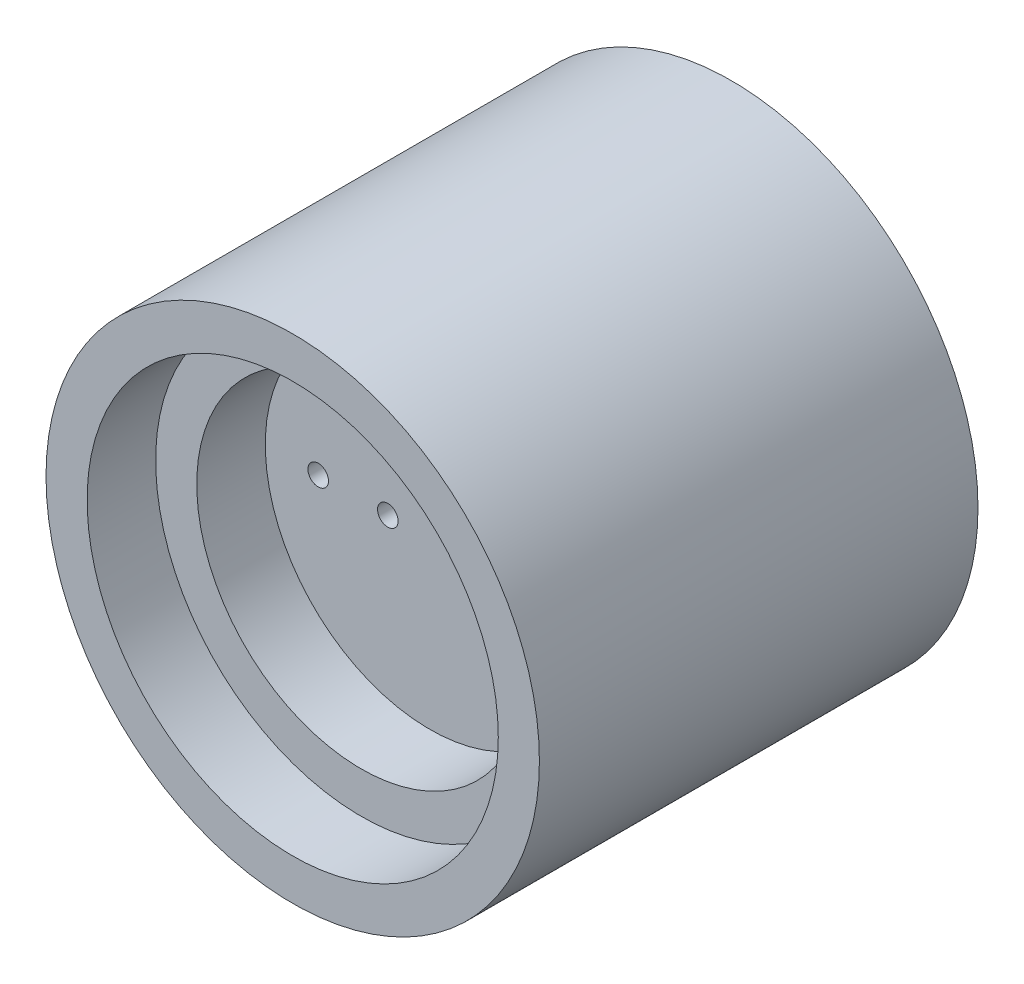
ISO-10303-21;
HEADER;
FILE_DESCRIPTION(('STEP AP214'),'2;1');
FILE_NAME('part.step','',(''),(''),'','','');
FILE_SCHEMA(('AUTOMOTIVE_DESIGN { 1 0 10303 214 1 1 1 1 }'));
ENDSEC;
DATA;
#1=APPLICATION_CONTEXT('core data for automotive mechanical design processes');
#2=APPLICATION_PROTOCOL_DEFINITION('international standard','automotive_design',2000,#1);
#3=PRODUCT_CONTEXT('',#1,'mechanical');
#4=PRODUCT('Part','Part','',(#3));
#5=PRODUCT_RELATED_PRODUCT_CATEGORY('part','',(#4));
#6=PRODUCT_DEFINITION_FORMATION('','',#4);
#7=PRODUCT_DEFINITION_CONTEXT('part definition',#1,'design');
#8=PRODUCT_DEFINITION('design','',#6,#7);
#9=PRODUCT_DEFINITION_SHAPE('','',#8);
#10=(LENGTH_UNIT() NAMED_UNIT(*) SI_UNIT(.MILLI.,.METRE.));
#11=(NAMED_UNIT(*) PLANE_ANGLE_UNIT() SI_UNIT($,.RADIAN.));
#12=(NAMED_UNIT(*) SI_UNIT($,.STERADIAN.) SOLID_ANGLE_UNIT());
#13=UNCERTAINTY_MEASURE_WITH_UNIT(LENGTH_MEASURE(1.E-05),#10,'distance_accuracy_value','');
#14=(GEOMETRIC_REPRESENTATION_CONTEXT(3) GLOBAL_UNCERTAINTY_ASSIGNED_CONTEXT((#13)) GLOBAL_UNIT_ASSIGNED_CONTEXT((#10,
#11,#12)) REPRESENTATION_CONTEXT('',''));
#15=CARTESIAN_POINT('',(0.,0.,0.));
#16=DIRECTION('',(0.,0.,1.));
#17=DIRECTION('',(1.,0.,0.));
#18=AXIS2_PLACEMENT_3D('',#15,#16,#17);
#19=CARTESIAN_POINT('',(2.95,0.,-4.2));
#20=DIRECTION('',(0.,0.,1.));
#21=DIRECTION('',(1.,0.,0.));
#22=AXIS2_PLACEMENT_3D('',#19,#20,#21);
#23=PLANE('',#22);
#24=CARTESIAN_POINT('',(2.95,0.,-4.2));
#25=DIRECTION('',(0.,0.,-1.));
#26=DIRECTION('',(-1.,0.,0.));
#27=AXIS2_PLACEMENT_3D('',#24,#25,#26);
#28=CIRCLE('',#27,2.75);
#29=CARTESIAN_POINT('',(0.200000000000001,0.,-4.2));
#30=VERTEX_POINT('',#29);
#31=EDGE_CURVE('E19',#30,#30,#28,.T.);
#32=ORIENTED_EDGE('',*,*,#31,.T.);
#33=EDGE_LOOP('',(#32));
#34=FACE_BOUND('',#33,.T.);
#35=CARTESIAN_POINT('',(1.68,0.,-4.2));
#36=DIRECTION('',(0.,0.,1.));
#37=DIRECTION('',(1.,0.,0.));
#38=AXIS2_PLACEMENT_3D('',#35,#36,#37);
#39=CIRCLE('',#38,0.375);
#40=CARTESIAN_POINT('',(2.055,0.,-4.2));
#41=VERTEX_POINT('',#40);
#42=EDGE_CURVE('E87',#41,#41,#39,.T.);
#43=ORIENTED_EDGE('',*,*,#42,.T.);
#44=EDGE_LOOP('',(#43));
#45=FACE_BOUND('',#44,.T.);
#46=CARTESIAN_POINT('',(4.22,0.,-4.2));
#47=DIRECTION('',(0.,0.,1.));
#48=DIRECTION('',(1.,0.,0.));
#49=AXIS2_PLACEMENT_3D('',#46,#47,#48);
#50=CIRCLE('',#49,0.375);
#51=CARTESIAN_POINT('',(4.595,0.,-4.2));
#52=VERTEX_POINT('',#51);
#53=EDGE_CURVE('E89',#52,#52,#50,.T.);
#54=ORIENTED_EDGE('',*,*,#53,.T.);
#55=EDGE_LOOP('',(#54));
#56=FACE_BOUND('',#55,.T.);
#57=ADVANCED_FACE('F16',(#34,#45,#56),#23,.F.);
#58=CARTESIAN_POINT('',(2.95,0.,-4.2));
#59=DIRECTION('',(0.,0.,-1.));
#60=DIRECTION('',(-1.,0.,0.));
#61=AXIS2_PLACEMENT_3D('',#58,#59,#60);
#62=CYLINDRICAL_SURFACE('',#61,2.75);
#63=CARTESIAN_POINT('',(2.95,0.,-5.2));
#64=DIRECTION('',(0.,0.,-1.));
#65=DIRECTION('',(-1.,0.,0.));
#66=AXIS2_PLACEMENT_3D('',#63,#64,#65);
#67=CIRCLE('',#66,2.75);
#68=CARTESIAN_POINT('',(0.200000000000001,0.,-5.2));
#69=VERTEX_POINT('',#68);
#70=EDGE_CURVE('E78',#69,#69,#67,.T.);
#71=ORIENTED_EDGE('',*,*,#70,.T.);
#72=EDGE_LOOP('',(#71));
#73=FACE_BOUND('',#72,.T.);
#74=ORIENTED_EDGE('',*,*,#31,.F.);
#75=EDGE_LOOP('',(#74));
#76=FACE_BOUND('',#75,.T.);
#77=ADVANCED_FACE('F98',(#73,#76),#62,.F.);
#78=CARTESIAN_POINT('',(4.22,0.,-32.0665927567458));
#79=DIRECTION('',(0.,0.,1.));
#80=DIRECTION('',(1.,0.,0.));
#81=AXIS2_PLACEMENT_3D('',#78,#79,#80);
#82=CYLINDRICAL_SURFACE('',#81,0.375);
#83=CARTESIAN_POINT('',(4.22,0.,0.));
#84=DIRECTION('',(0.,0.,1.));
#85=DIRECTION('',(1.,0.,0.));
#86=AXIS2_PLACEMENT_3D('',#83,#84,#85);
#87=CIRCLE('',#86,0.375);
#88=CARTESIAN_POINT('',(4.595,0.,0.));
#89=VERTEX_POINT('',#88);
#90=EDGE_CURVE('E75',#89,#89,#87,.F.);
#91=ORIENTED_EDGE('',*,*,#90,.F.);
#92=EDGE_LOOP('',(#91));
#93=FACE_BOUND('',#92,.T.);
#94=ORIENTED_EDGE('',*,*,#53,.F.);
#95=EDGE_LOOP('',(#94));
#96=FACE_BOUND('',#95,.T.);
#97=ADVANCED_FACE('F100',(#93,#96),#82,.F.);
#98=CARTESIAN_POINT('',(1.68,0.,-32.0665927567458));
#99=DIRECTION('',(0.,0.,1.));
#100=DIRECTION('',(1.,0.,0.));
#101=AXIS2_PLACEMENT_3D('',#98,#99,#100);
#102=CYLINDRICAL_SURFACE('',#101,0.375);
#103=CARTESIAN_POINT('',(1.68,0.,0.));
#104=DIRECTION('',(0.,0.,1.));
#105=DIRECTION('',(1.,0.,0.));
#106=AXIS2_PLACEMENT_3D('',#103,#104,#105);
#107=CIRCLE('',#106,0.375);
#108=CARTESIAN_POINT('',(2.055,0.,0.));
#109=VERTEX_POINT('',#108);
#110=EDGE_CURVE('E72',#109,#109,#107,.F.);
#111=ORIENTED_EDGE('',*,*,#110,.F.);
#112=EDGE_LOOP('',(#111));
#113=FACE_BOUND('',#112,.T.);
#114=ORIENTED_EDGE('',*,*,#42,.F.);
#115=EDGE_LOOP('',(#114));
#116=FACE_BOUND('',#115,.T.);
#117=ADVANCED_FACE('F107',(#113,#116),#102,.F.);
#118=CARTESIAN_POINT('',(-1.53,0.,28.0665927567458));
#119=DIRECTION('',(0.,0.,-1.));
#120=DIRECTION('',(-1.,0.,0.));
#121=AXIS2_PLACEMENT_3D('',#118,#119,#120);
#122=CYLINDRICAL_SURFACE('',#121,0.375);
#123=CARTESIAN_POINT('',(-1.53,0.,0.));
#124=DIRECTION('',(0.,0.,-1.));
#125=DIRECTION('',(-1.,0.,0.));
#126=AXIS2_PLACEMENT_3D('',#123,#124,#125);
#127=CIRCLE('',#126,0.375);
#128=CARTESIAN_POINT('',(-1.905,0.,0.));
#129=VERTEX_POINT('',#128);
#130=EDGE_CURVE('E69',#129,#129,#127,.T.);
#131=ORIENTED_EDGE('',*,*,#130,.F.);
#132=EDGE_LOOP('',(#131));
#133=FACE_BOUND('',#132,.T.);
#134=CARTESIAN_POINT('',(-1.53,0.,-2.));
#135=DIRECTION('',(0.,0.,-1.));
#136=DIRECTION('',(-1.,0.,0.));
#137=AXIS2_PLACEMENT_3D('',#134,#135,#136);
#138=CIRCLE('',#137,0.375);
#139=CARTESIAN_POINT('',(-1.905,0.,-2.));
#140=VERTEX_POINT('',#139);
#141=EDGE_CURVE('E84',#140,#140,#138,.T.);
#142=ORIENTED_EDGE('',*,*,#141,.T.);
#143=EDGE_LOOP('',(#142));
#144=FACE_BOUND('',#143,.T.);
#145=ADVANCED_FACE('F167',(#133,#144),#122,.F.);
#146=CARTESIAN_POINT('',(-4.07,0.,28.0665927567458));
#147=DIRECTION('',(0.,0.,-1.));
#148=DIRECTION('',(-1.,0.,0.));
#149=AXIS2_PLACEMENT_3D('',#146,#147,#148);
#150=CYLINDRICAL_SURFACE('',#149,0.375);
#151=CARTESIAN_POINT('',(-4.07,0.,0.));
#152=DIRECTION('',(0.,0.,-1.));
#153=DIRECTION('',(-1.,0.,0.));
#154=AXIS2_PLACEMENT_3D('',#151,#152,#153);
#155=CIRCLE('',#154,0.375);
#156=CARTESIAN_POINT('',(-4.445,0.,0.));
#157=VERTEX_POINT('',#156);
#158=EDGE_CURVE('E66',#157,#157,#155,.T.);
#159=ORIENTED_EDGE('',*,*,#158,.F.);
#160=EDGE_LOOP('',(#159));
#161=FACE_BOUND('',#160,.T.);
#162=CARTESIAN_POINT('',(-4.07,0.,-2.));
#163=DIRECTION('',(0.,0.,-1.));
#164=DIRECTION('',(-1.,0.,0.));
#165=AXIS2_PLACEMENT_3D('',#162,#163,#164);
#166=CIRCLE('',#165,0.375);
#167=CARTESIAN_POINT('',(-4.445,0.,-2.));
#168=VERTEX_POINT('',#167);
#169=EDGE_CURVE('E81',#168,#168,#166,.T.);
#170=ORIENTED_EDGE('',*,*,#169,.T.);
#171=EDGE_LOOP('',(#170));
#172=FACE_BOUND('',#171,.T.);
#173=ADVANCED_FACE('F163',(#161,#172),#150,.F.);
#174=CARTESIAN_POINT('',(-2.8,0.,-2.));
#175=DIRECTION('',(0.,0.,1.));
#176=DIRECTION('',(1.,0.,0.));
#177=AXIS2_PLACEMENT_3D('',#174,#175,#176);
#178=PLANE('',#177);
#179=CARTESIAN_POINT('',(-2.8,0.,-2.));
#180=DIRECTION('',(0.,0.,-1.));
#181=DIRECTION('',(-1.,0.,0.));
#182=AXIS2_PLACEMENT_3D('',#179,#180,#181);
#183=CIRCLE('',#182,2.9);
#184=CARTESIAN_POINT('',(-5.7,0.,-2.));
#185=VERTEX_POINT('',#184);
#186=EDGE_CURVE('E47',#185,#185,#183,.T.);
#187=ORIENTED_EDGE('',*,*,#186,.T.);
#188=EDGE_LOOP('',(#187));
#189=FACE_BOUND('',#188,.T.);
#190=ORIENTED_EDGE('',*,*,#169,.F.);
#191=EDGE_LOOP('',(#190));
#192=FACE_BOUND('',#191,.T.);
#193=ORIENTED_EDGE('',*,*,#141,.F.);
#194=EDGE_LOOP('',(#193));
#195=FACE_BOUND('',#194,.T.);
#196=ADVANCED_FACE('F160',(#189,#192,#195),#178,.F.);
#197=CARTESIAN_POINT('',(0.,0.,-5.2));
#198=DIRECTION('',(0.,0.,1.));
#199=DIRECTION('',(1.,0.,0.));
#200=AXIS2_PLACEMENT_3D('',#197,#198,#199);
#201=PLANE('',#200);
#202=CARTESIAN_POINT('',(0.,0.,-5.2));
#203=DIRECTION('',(0.,0.,1.));
#204=DIRECTION('',(1.,0.,0.));
#205=AXIS2_PLACEMENT_3D('',#202,#203,#204);
#206=CIRCLE('',#205,5.75);
#207=CARTESIAN_POINT('',(0.149999999999999,-5.74804314527997,-5.2));
#208=VERTEX_POINT('',#207);
#209=CARTESIAN_POINT('',(0.15,5.74804314527997,-5.2));
#210=VERTEX_POINT('',#209);
#211=EDGE_CURVE('E46',#208,#210,#206,.T.);
#212=ORIENTED_EDGE('',*,*,#211,.F.);
#213=DIRECTION('',(0.,1.,0.));
#214=VECTOR('',#213,1.);
#215=CARTESIAN_POINT('',(0.15,5.74804314527997,-5.2));
#216=LINE('',#215,#214);
#217=EDGE_CURVE('E40',#210,#208,#216,.F.);
#218=ORIENTED_EDGE('',*,*,#217,.F.);
#219=EDGE_LOOP('',(#212,#218));
#220=FACE_BOUND('',#219,.T.);
#221=ORIENTED_EDGE('',*,*,#70,.F.);
#222=EDGE_LOOP('',(#221));
#223=FACE_BOUND('',#222,.T.);
#224=ADVANCED_FACE('F43',(#220,#223),#201,.F.);
#225=CARTESIAN_POINT('',(0.,0.,0.));
#226=DIRECTION('',(0.,0.,1.));
#227=DIRECTION('',(1.,0.,0.));
#228=AXIS2_PLACEMENT_3D('',#225,#226,#227);
#229=PLANE('',#228);
#230=CARTESIAN_POINT('',(0.,0.,0.));
#231=DIRECTION('',(0.,0.,1.));
#232=DIRECTION('',(1.,0.,0.));
#233=AXIS2_PLACEMENT_3D('',#230,#231,#232);
#234=CIRCLE('',#233,6.);
#235=CARTESIAN_POINT('',(6.,0.,0.));
#236=VERTEX_POINT('',#235);
#237=EDGE_CURVE('E56',#236,#236,#234,.T.);
#238=ORIENTED_EDGE('',*,*,#237,.T.);
#239=EDGE_LOOP('',(#238));
#240=FACE_BOUND('',#239,.T.);
#241=ORIENTED_EDGE('',*,*,#158,.T.);
#242=EDGE_LOOP('',(#241));
#243=FACE_BOUND('',#242,.T.);
#244=ORIENTED_EDGE('',*,*,#130,.T.);
#245=EDGE_LOOP('',(#244));
#246=FACE_BOUND('',#245,.T.);
#247=ORIENTED_EDGE('',*,*,#110,.T.);
#248=EDGE_LOOP('',(#247));
#249=FACE_BOUND('',#248,.T.);
#250=ORIENTED_EDGE('',*,*,#90,.T.);
#251=EDGE_LOOP('',(#250));
#252=FACE_BOUND('',#251,.T.);
#253=ADVANCED_FACE('F153',(#240,#243,#246,#249,#252),#229,.T.);
#254=CARTESIAN_POINT('',(-2.8,0.,-2.));
#255=DIRECTION('',(0.,0.,-1.));
#256=DIRECTION('',(-1.,0.,0.));
#257=AXIS2_PLACEMENT_3D('',#254,#255,#256);
#258=CYLINDRICAL_SURFACE('',#257,2.9);
#259=CARTESIAN_POINT('',(-2.8,0.,-3.));
#260=DIRECTION('',(0.,0.,-1.));
#261=DIRECTION('',(-1.,0.,0.));
#262=AXIS2_PLACEMENT_3D('',#259,#260,#261);
#263=CIRCLE('',#262,2.9);
#264=CARTESIAN_POINT('',(-5.7,0.,-3.));
#265=VERTEX_POINT('',#264);
#266=EDGE_CURVE('E318',#265,#265,#263,.F.);
#267=ORIENTED_EDGE('',*,*,#266,.F.);
#268=EDGE_LOOP('',(#267));
#269=FACE_BOUND('',#268,.T.);
#270=ORIENTED_EDGE('',*,*,#186,.F.);
#271=EDGE_LOOP('',(#270));
#272=FACE_BOUND('',#271,.T.);
#273=ADVANCED_FACE('F150',(#269,#272),#258,.F.);
#274=CARTESIAN_POINT('',(0.15,5.74804314527997,-5.2));
#275=DIRECTION('',(-1.,0.,0.));
#276=DIRECTION('',(0.,0.,1.));
#277=AXIS2_PLACEMENT_3D('',#274,#275,#276);
#278=PLANE('',#277);
#279=ORIENTED_EDGE('',*,*,#217,.T.);
#280=DIRECTION('',(0.,0.,1.));
#281=VECTOR('',#280,1.);
#282=CARTESIAN_POINT('',(0.149999999999999,-5.74804314527997,-5.2));
#283=LINE('',#282,#281);
#284=CARTESIAN_POINT('',(0.15,-5.74804314527997,-3.));
#285=VERTEX_POINT('',#284);
#286=EDGE_CURVE('E34',#285,#208,#283,.F.);
#287=ORIENTED_EDGE('',*,*,#286,.F.);
#288=DIRECTION('',(0.,1.,0.));
#289=VECTOR('',#288,1.);
#290=CARTESIAN_POINT('',(0.150000000000001,0.,-3.));
#291=LINE('',#290,#289);
#292=CARTESIAN_POINT('',(0.150000000000001,5.74804314527997,-3.));
#293=VERTEX_POINT('',#292);
#294=EDGE_CURVE('E53',#293,#285,#291,.F.);
#295=ORIENTED_EDGE('',*,*,#294,.F.);
#296=DIRECTION('',(0.,0.,1.));
#297=VECTOR('',#296,1.);
#298=CARTESIAN_POINT('',(0.15,5.74804314527997,-5.2));
#299=LINE('',#298,#297);
#300=EDGE_CURVE('E50',#210,#293,#299,.T.);
#301=ORIENTED_EDGE('',*,*,#300,.F.);
#302=EDGE_LOOP('',(#279,#287,#295,#301));
#303=FACE_BOUND('',#302,.T.);
#304=ADVANCED_FACE('F51',(#303),#278,.T.);
#305=CARTESIAN_POINT('',(0.,0.,-5.2));
#306=DIRECTION('',(0.,0.,1.));
#307=DIRECTION('',(1.,0.,0.));
#308=AXIS2_PLACEMENT_3D('',#305,#306,#307);
#309=CYLINDRICAL_SURFACE('',#308,5.75);
#310=ORIENTED_EDGE('',*,*,#211,.T.);
#311=ORIENTED_EDGE('',*,*,#300,.T.);
#312=CARTESIAN_POINT('',(0.,0.,-3.));
#313=DIRECTION('',(0.,0.,1.));
#314=DIRECTION('',(1.,0.,0.));
#315=AXIS2_PLACEMENT_3D('',#312,#313,#314);
#316=CIRCLE('',#315,5.75);
#317=EDGE_CURVE('E322',#285,#293,#316,.T.);
#318=ORIENTED_EDGE('',*,*,#317,.F.);
#319=ORIENTED_EDGE('',*,*,#286,.T.);
#320=EDGE_LOOP('',(#310,#311,#318,#319));
#321=FACE_BOUND('',#320,.T.);
#322=ADVANCED_FACE('F58',(#321),#309,.T.);
#323=CARTESIAN_POINT('',(0.,0.,-3.));
#324=DIRECTION('',(0.,0.,1.));
#325=DIRECTION('',(1.,0.,0.));
#326=AXIS2_PLACEMENT_3D('',#323,#324,#325);
#327=CYLINDRICAL_SURFACE('',#326,6.);
#328=ORIENTED_EDGE('',*,*,#237,.F.);
#329=EDGE_LOOP('',(#328));
#330=FACE_BOUND('',#329,.T.);
#331=CARTESIAN_POINT('',(0.,0.,2.5));
#332=DIRECTION('',(0.,0.,1.));
#333=DIRECTION('',(1.,0.,0.));
#334=AXIS2_PLACEMENT_3D('',#331,#332,#333);
#335=CIRCLE('',#334,6.);
#336=CARTESIAN_POINT('',(6.,0.,2.5));
#337=VERTEX_POINT('',#336);
#338=EDGE_CURVE('E326',#337,#337,#335,.F.);
#339=ORIENTED_EDGE('',*,*,#338,.F.);
#340=EDGE_LOOP('',(#339));
#341=FACE_BOUND('',#340,.T.);
#342=ADVANCED_FACE('F141',(#330,#341),#327,.F.);
#343=CARTESIAN_POINT('',(6.,0.,-3.));
#344=DIRECTION('',(0.,0.,-1.));
#345=DIRECTION('',(-1.,0.,0.));
#346=AXIS2_PLACEMENT_3D('',#343,#344,#345);
#347=PLANE('',#346);
#348=CARTESIAN_POINT('',(0.,0.,-3.));
#349=DIRECTION('',(0.,0.,1.));
#350=DIRECTION('',(1.,0.,0.));
#351=AXIS2_PLACEMENT_3D('',#348,#349,#350);
#352=CIRCLE('',#351,6.);
#353=CARTESIAN_POINT('',(6.,0.,-3.));
#354=VERTEX_POINT('',#353);
#355=EDGE_CURVE('E329',#354,#354,#352,.F.);
#356=ORIENTED_EDGE('',*,*,#355,.T.);
#357=EDGE_LOOP('',(#356));
#358=FACE_BOUND('',#357,.T.);
#359=ORIENTED_EDGE('',*,*,#294,.T.);
#360=ORIENTED_EDGE('',*,*,#317,.T.);
#361=EDGE_LOOP('',(#359,#360));
#362=FACE_BOUND('',#361,.T.);
#363=ORIENTED_EDGE('',*,*,#266,.T.);
#364=EDGE_LOOP('',(#363));
#365=FACE_BOUND('',#364,.T.);
#366=ADVANCED_FACE('F137',(#358,#362,#365),#347,.T.);
#367=CARTESIAN_POINT('',(7.5,0.,2.5));
#368=DIRECTION('',(0.,0.,1.));
#369=DIRECTION('',(1.,0.,0.));
#370=AXIS2_PLACEMENT_3D('',#367,#368,#369);
#371=PLANE('',#370);
#372=ORIENTED_EDGE('',*,*,#338,.T.);
#373=EDGE_LOOP('',(#372));
#374=FACE_BOUND('',#373,.T.);
#375=CARTESIAN_POINT('',(0.,0.,2.5));
#376=DIRECTION('',(0.,0.,1.));
#377=DIRECTION('',(1.,0.,0.));
#378=AXIS2_PLACEMENT_3D('',#375,#376,#377);
#379=CIRCLE('',#378,7.5);
#380=CARTESIAN_POINT('',(7.5,0.,2.5));
#381=VERTEX_POINT('',#380);
#382=EDGE_CURVE('E332',#381,#381,#379,.T.);
#383=ORIENTED_EDGE('',*,*,#382,.T.);
#384=EDGE_LOOP('',(#383));
#385=FACE_BOUND('',#384,.T.);
#386=ADVANCED_FACE('F133',(#374,#385),#371,.T.);
#387=CARTESIAN_POINT('',(0.,0.,-3.));
#388=DIRECTION('',(0.,0.,1.));
#389=DIRECTION('',(1.,0.,0.));
#390=AXIS2_PLACEMENT_3D('',#387,#388,#389);
#391=CYLINDRICAL_SURFACE('',#390,6.);
#392=CARTESIAN_POINT('',(0.,0.,-11.));
#393=DIRECTION('',(0.,0.,1.));
#394=DIRECTION('',(1.,0.,0.));
#395=AXIS2_PLACEMENT_3D('',#392,#393,#394);
#396=CIRCLE('',#395,6.);
#397=CARTESIAN_POINT('',(6.,0.,-11.));
#398=VERTEX_POINT('',#397);
#399=EDGE_CURVE('E335',#398,#398,#396,.T.);
#400=ORIENTED_EDGE('',*,*,#399,.F.);
#401=EDGE_LOOP('',(#400));
#402=FACE_BOUND('',#401,.T.);
#403=ORIENTED_EDGE('',*,*,#355,.F.);
#404=EDGE_LOOP('',(#403));
#405=FACE_BOUND('',#404,.T.);
#406=ADVANCED_FACE('F129',(#402,#405),#391,.F.);
#407=CARTESIAN_POINT('',(0.,0.,-3.));
#408=DIRECTION('',(0.,0.,1.));
#409=DIRECTION('',(1.,0.,0.));
#410=AXIS2_PLACEMENT_3D('',#407,#408,#409);
#411=CYLINDRICAL_SURFACE('',#410,7.5);
#412=ORIENTED_EDGE('',*,*,#382,.F.);
#413=EDGE_LOOP('',(#412));
#414=FACE_BOUND('',#413,.T.);
#415=CARTESIAN_POINT('',(0.,0.,5.));
#416=DIRECTION('',(0.,0.,1.));
#417=DIRECTION('',(1.,0.,0.));
#418=AXIS2_PLACEMENT_3D('',#415,#416,#417);
#419=CIRCLE('',#418,7.5);
#420=CARTESIAN_POINT('',(7.5,0.,5.));
#421=VERTEX_POINT('',#420);
#422=EDGE_CURVE('E338',#421,#421,#419,.F.);
#423=ORIENTED_EDGE('',*,*,#422,.F.);
#424=EDGE_LOOP('',(#423));
#425=FACE_BOUND('',#424,.T.);
#426=ADVANCED_FACE('F125',(#414,#425),#411,.F.);
#427=CARTESIAN_POINT('',(9.,0.,-11.));
#428=DIRECTION('',(0.,0.,-1.));
#429=DIRECTION('',(-1.,0.,0.));
#430=AXIS2_PLACEMENT_3D('',#427,#428,#429);
#431=PLANE('',#430);
#432=CARTESIAN_POINT('',(0.,0.,-11.));
#433=DIRECTION('',(0.,0.,1.));
#434=DIRECTION('',(1.,0.,0.));
#435=AXIS2_PLACEMENT_3D('',#432,#433,#434);
#436=CIRCLE('',#435,9.);
#437=CARTESIAN_POINT('',(9.,0.,-11.));
#438=VERTEX_POINT('',#437);
#439=EDGE_CURVE('E25',#438,#438,#436,.T.);
#440=ORIENTED_EDGE('',*,*,#439,.F.);
#441=EDGE_LOOP('',(#440));
#442=FACE_BOUND('',#441,.T.);
#443=ORIENTED_EDGE('',*,*,#399,.T.);
#444=EDGE_LOOP('',(#443));
#445=FACE_BOUND('',#444,.T.);
#446=ADVANCED_FACE('F118',(#442,#445),#431,.T.);
#447=CARTESIAN_POINT('',(7.5,0.,5.));
#448=DIRECTION('',(0.,0.,1.));
#449=DIRECTION('',(1.,0.,0.));
#450=AXIS2_PLACEMENT_3D('',#447,#448,#449);
#451=PLANE('',#450);
#452=ORIENTED_EDGE('',*,*,#422,.T.);
#453=EDGE_LOOP('',(#452));
#454=FACE_BOUND('',#453,.T.);
#455=CARTESIAN_POINT('',(0.,0.,5.));
#456=DIRECTION('',(0.,0.,1.));
#457=DIRECTION('',(1.,0.,0.));
#458=AXIS2_PLACEMENT_3D('',#455,#456,#457);
#459=CIRCLE('',#458,9.);
#460=CARTESIAN_POINT('',(9.,0.,5.));
#461=VERTEX_POINT('',#460);
#462=EDGE_CURVE('E11',#461,#461,#459,.F.);
#463=ORIENTED_EDGE('',*,*,#462,.F.);
#464=EDGE_LOOP('',(#463));
#465=FACE_BOUND('',#464,.T.);
#466=ADVANCED_FACE('F112',(#454,#465),#451,.T.);
#467=CARTESIAN_POINT('',(0.,0.,-3.));
#468=DIRECTION('',(0.,0.,1.));
#469=DIRECTION('',(1.,0.,0.));
#470=AXIS2_PLACEMENT_3D('',#467,#468,#469);
#471=CYLINDRICAL_SURFACE('',#470,9.);
#472=ORIENTED_EDGE('',*,*,#462,.T.);
#473=EDGE_LOOP('',(#472));
#474=FACE_BOUND('',#473,.T.);
#475=ORIENTED_EDGE('',*,*,#439,.T.);
#476=EDGE_LOOP('',(#475));
#477=FACE_BOUND('',#476,.T.);
#478=ADVANCED_FACE('F110',(#474,#477),#471,.T.);
#479=CLOSED_SHELL('',(#57,#77,#97,#117,#145,#173,#196,#224,#253,#273,#304,#322,#342,#366,#386,
#406,#426,#446,#466,#478));
#480=MANIFOLD_SOLID_BREP('B1',#479);
#481=ADVANCED_BREP_SHAPE_REPRESENTATION('',(#18,#480),#14);
#482=SHAPE_DEFINITION_REPRESENTATION(#9,#481);
ENDSEC;
END-ISO-10303-21;
